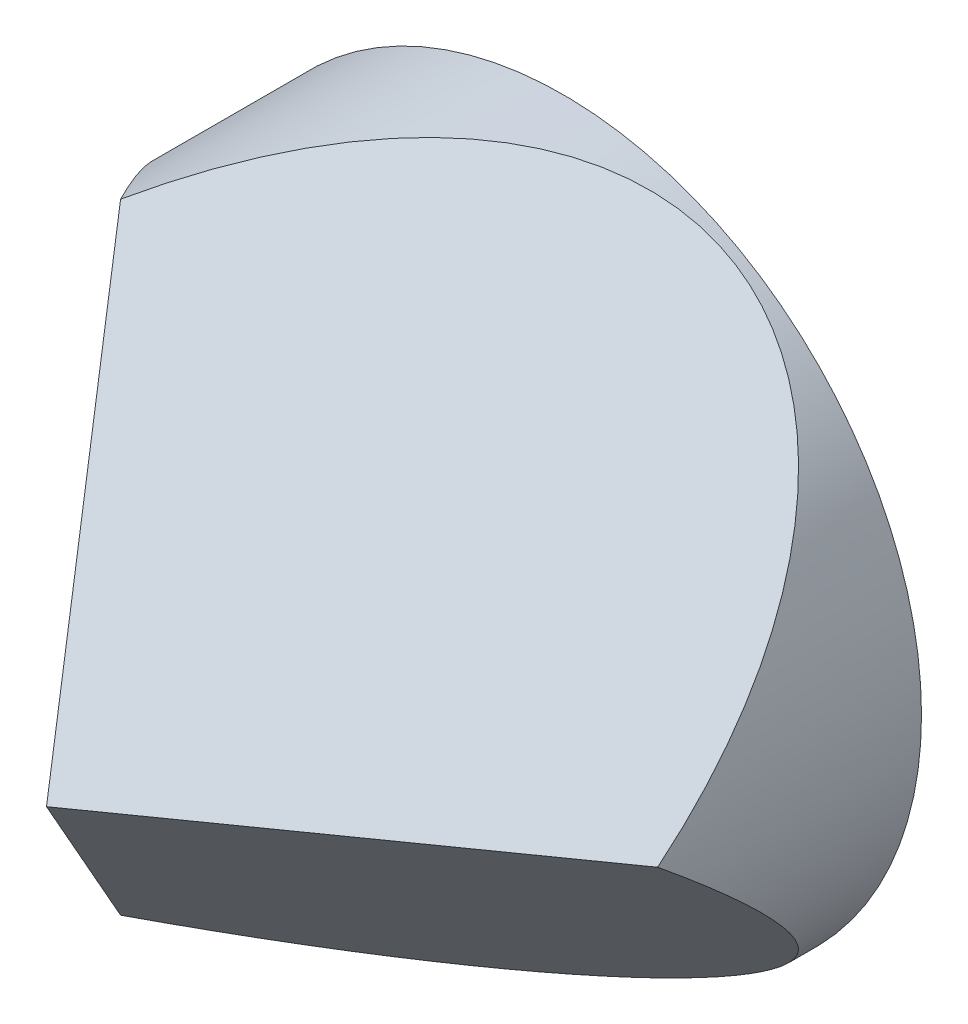
ISO-10303-21;
HEADER;
FILE_DESCRIPTION(('STEP AP214'),'2;1');
FILE_NAME('part.step','',(''),(''),'','','');
FILE_SCHEMA(('AUTOMOTIVE_DESIGN { 1 0 10303 214 1 1 1 1 }'));
ENDSEC;
DATA;
#1=APPLICATION_CONTEXT('core data for automotive mechanical design processes');
#2=APPLICATION_PROTOCOL_DEFINITION('international standard','automotive_design',2000,#1);
#3=PRODUCT_CONTEXT('',#1,'mechanical');
#4=PRODUCT('Part','Part','',(#3));
#5=PRODUCT_RELATED_PRODUCT_CATEGORY('part','',(#4));
#6=PRODUCT_DEFINITION_FORMATION('','',#4);
#7=PRODUCT_DEFINITION_CONTEXT('part definition',#1,'design');
#8=PRODUCT_DEFINITION('design','',#6,#7);
#9=PRODUCT_DEFINITION_SHAPE('','',#8);
#10=(LENGTH_UNIT() NAMED_UNIT(*) SI_UNIT(.MILLI.,.METRE.));
#11=(NAMED_UNIT(*) PLANE_ANGLE_UNIT() SI_UNIT($,.RADIAN.));
#12=(NAMED_UNIT(*) SI_UNIT($,.STERADIAN.) SOLID_ANGLE_UNIT());
#13=UNCERTAINTY_MEASURE_WITH_UNIT(LENGTH_MEASURE(1.E-05),#10,'distance_accuracy_value','');
#14=(GEOMETRIC_REPRESENTATION_CONTEXT(3) GLOBAL_UNCERTAINTY_ASSIGNED_CONTEXT((#13)) GLOBAL_UNIT_ASSIGNED_CONTEXT((#10,
#11,#12)) REPRESENTATION_CONTEXT('',''));
#15=CARTESIAN_POINT('',(0.,0.,0.));
#16=DIRECTION('',(0.,0.,1.));
#17=DIRECTION('',(1.,0.,0.));
#18=AXIS2_PLACEMENT_3D('',#15,#16,#17);
#19=CARTESIAN_POINT('',(0.,0.,52.35));
#20=DIRECTION('',(0.,0.,-1.));
#21=DIRECTION('',(-1.,0.,0.));
#22=AXIS2_PLACEMENT_3D('',#19,#20,#21);
#23=CYLINDRICAL_SURFACE('',#22,36.25);
#24=CARTESIAN_POINT('',(0.,0.,0.));
#25=DIRECTION('',(0.,0.,1.));
#26=DIRECTION('',(1.,0.,0.));
#27=AXIS2_PLACEMENT_3D('',#24,#25,#26);
#28=CIRCLE('',#27,36.25);
#29=CARTESIAN_POINT('',(36.25,0.,0.));
#30=VERTEX_POINT('',#29);
#31=EDGE_CURVE('E73',#30,#30,#28,.T.);
#32=ORIENTED_EDGE('',*,*,#31,.T.);
#33=EDGE_LOOP('',(#32));
#34=FACE_BOUND('',#33,.T.);
#35=CARTESIAN_POINT('',(0.,0.,52.35));
#36=DIRECTION('',(0.408220021868278,0.70705781854274,0.577430216548671));
#37=DIRECTION('',(0.288715108274334,0.500069236443899,-0.816440043736559));
#38=AXIS2_PLACEMENT_3D('',#35,#36,#37);
#39=ELLIPSE('',#38,62.7781487028304,36.25);
#40=CARTESIAN_POINT('',(36.25,0.,26.7227027636806));
#41=VERTEX_POINT('',#40);
#42=CARTESIAN_POINT('',(-18.125,31.3934208871859,26.7227027636804));
#43=VERTEX_POINT('',#42);
#44=EDGE_CURVE('E72',#41,#43,#39,.T.);
#45=ORIENTED_EDGE('',*,*,#44,.F.);
#46=CARTESIAN_POINT('',(0.,0.,52.35));
#47=DIRECTION('',(-0.408220021868278,0.70705781854274,-0.577430216548671));
#48=DIRECTION('',(0.288715108274334,-0.5000692364439,-0.816440043736559));
#49=AXIS2_PLACEMENT_3D('',#46,#47,#48);
#50=ELLIPSE('',#49,62.7781487028303,36.25);
#51=CARTESIAN_POINT('',(-18.125,-31.3934208871859,26.7227027636804));
#52=VERTEX_POINT('',#51);
#53=EDGE_CURVE('E50',#41,#52,#50,.T.);
#54=ORIENTED_EDGE('',*,*,#53,.T.);
#55=CARTESIAN_POINT('',(0.,0.,52.35));
#56=DIRECTION('',(0.816440043736559,0.,-0.577430216548671));
#57=DIRECTION('',(-0.577430216548671,0.,-0.816440043736559));
#58=AXIS2_PLACEMENT_3D('',#55,#56,#57);
#59=ELLIPSE('',#58,62.7781487028303,36.25);
#60=EDGE_CURVE('E57',#52,#43,#59,.T.);
#61=ORIENTED_EDGE('',*,*,#60,.T.);
#62=EDGE_LOOP('',(#45,#54,#61));
#63=FACE_BOUND('',#62,.T.);
#64=ADVANCED_FACE('F37',(#34,#63),#23,.T.);
#65=CARTESIAN_POINT('',(0.,-39.5,52.35));
#66=DIRECTION('',(0.816440043736559,0.,-0.577430216548671));
#67=DIRECTION('',(-0.577430216548671,0.,-0.816440043736559));
#68=AXIS2_PLACEMENT_3D('',#65,#66,#67);
#69=PLANE('',#68);
#70=ORIENTED_EDGE('',*,*,#60,.F.);
#71=DIRECTION('',(0.408276553188406,0.707155733661414,0.577270321830581));
#72=VECTOR('',#71,1.);
#73=CARTESIAN_POINT('',(-11.4042466675147,-19.7527346501834,36.2253092907749));
#74=LINE('',#73,#72);
#75=CARTESIAN_POINT('',(0.,0.,52.35));
#76=VERTEX_POINT('',#75);
#77=EDGE_CURVE('E64',#52,#76,#74,.T.);
#78=ORIENTED_EDGE('',*,*,#77,.T.);
#79=DIRECTION('',(0.408276553188406,-0.707155733661414,0.577270321830581));
#80=VECTOR('',#79,1.);
#81=CARTESIAN_POINT('',(11.4042466675147,-19.7527346501834,68.4746907092251));
#82=LINE('',#81,#80);
#83=EDGE_CURVE('E44',#43,#76,#82,.T.);
#84=ORIENTED_EDGE('',*,*,#83,.F.);
#85=EDGE_LOOP('',(#70,#78,#84));
#86=FACE_BOUND('',#85,.T.);
#87=ADVANCED_FACE('F69',(#86),#69,.F.);
#88=CARTESIAN_POINT('',(0.,0.,0.));
#89=DIRECTION('',(0.,0.,1.));
#90=DIRECTION('',(1.,0.,0.));
#91=AXIS2_PLACEMENT_3D('',#88,#89,#90);
#92=PLANE('',#91);
#93=ORIENTED_EDGE('',*,*,#31,.F.);
#94=EDGE_LOOP('',(#93));
#95=FACE_BOUND('',#94,.T.);
#96=ADVANCED_FACE('F84',(#95),#92,.F.);
#97=CARTESIAN_POINT('',(53.6935750346353,-30.9999999999999,52.35));
#98=DIRECTION('',(0.408220021868278,0.70705781854274,0.577430216548671));
#99=DIRECTION('',(0.,-0.632534350546001,0.774532307511668));
#100=AXIS2_PLACEMENT_3D('',#97,#98,#99);
#101=PLANE('',#100);
#102=DIRECTION('',(-0.816553106376811,0.,0.577270321830579));
#103=VECTOR('',#102,1.);
#104=CARTESIAN_POINT('',(35.800673082831,0.,27.040358886786));
#105=LINE('',#104,#103);
#106=EDGE_CURVE('E11',#41,#76,#105,.T.);
#107=ORIENTED_EDGE('',*,*,#106,.F.);
#108=ORIENTED_EDGE('',*,*,#44,.T.);
#109=ORIENTED_EDGE('',*,*,#83,.T.);
#110=EDGE_LOOP('',(#107,#108,#109));
#111=FACE_BOUND('',#110,.T.);
#112=ADVANCED_FACE('F71',(#111),#101,.T.);
#113=CARTESIAN_POINT('',(46.3323591024675,26.7499999999999,52.35));
#114=DIRECTION('',(-0.408220021868278,0.70705781854274,-0.577430216548671));
#115=DIRECTION('',(0.,0.632534350546001,0.774532307511668));
#116=AXIS2_PLACEMENT_3D('',#113,#114,#115);
#117=PLANE('',#116);
#118=ORIENTED_EDGE('',*,*,#106,.T.);
#119=ORIENTED_EDGE('',*,*,#77,.F.);
#120=ORIENTED_EDGE('',*,*,#53,.F.);
#121=EDGE_LOOP('',(#118,#119,#120));
#122=FACE_BOUND('',#121,.T.);
#123=ADVANCED_FACE('F63',(#122),#117,.F.);
#124=CLOSED_SHELL('',(#64,#87,#96,#112,#123));
#125=MANIFOLD_SOLID_BREP('B2',#124);
#126=ADVANCED_BREP_SHAPE_REPRESENTATION('',(#18,#125),#14);
#127=SHAPE_DEFINITION_REPRESENTATION(#9,#126);
ENDSEC;
END-ISO-10303-21;
